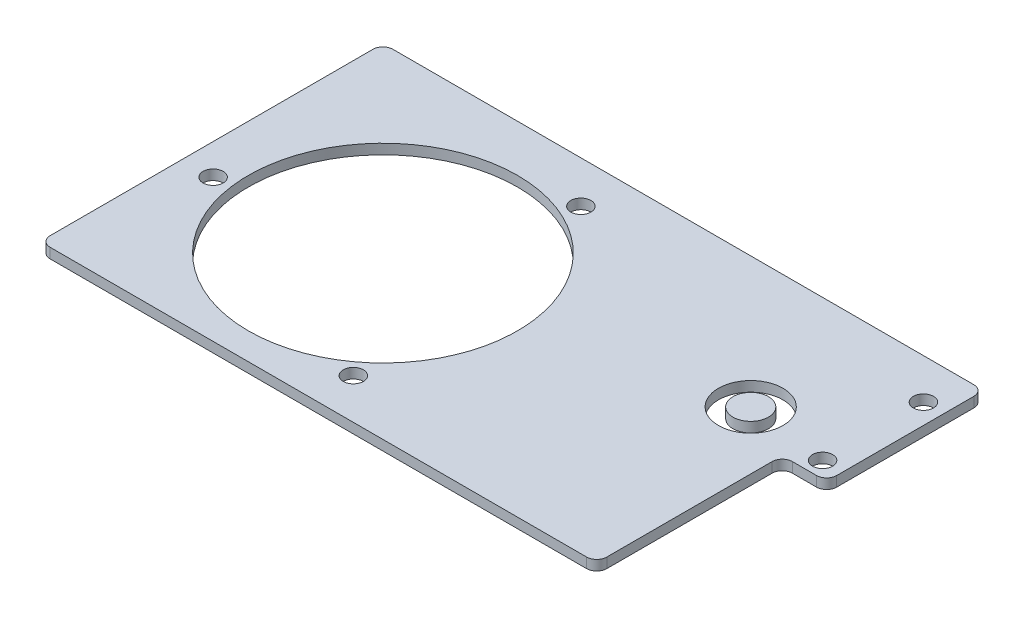
ISO-10303-21;
HEADER;
FILE_DESCRIPTION(('STEP AP214'),'2;1');
FILE_NAME('part.step','',(''),(''),'','','');
FILE_SCHEMA(('AUTOMOTIVE_DESIGN { 1 0 10303 214 1 1 1 1 }'));
ENDSEC;
DATA;
#1=APPLICATION_CONTEXT('core data for automotive mechanical design processes');
#2=APPLICATION_PROTOCOL_DEFINITION('international standard','automotive_design',2000,#1);
#3=PRODUCT_CONTEXT('',#1,'mechanical');
#4=PRODUCT('Part','Part','',(#3));
#5=PRODUCT_RELATED_PRODUCT_CATEGORY('part','',(#4));
#6=PRODUCT_DEFINITION_FORMATION('','',#4);
#7=PRODUCT_DEFINITION_CONTEXT('part definition',#1,'design');
#8=PRODUCT_DEFINITION('design','',#6,#7);
#9=PRODUCT_DEFINITION_SHAPE('','',#8);
#10=(LENGTH_UNIT() NAMED_UNIT(*) SI_UNIT(.MILLI.,.METRE.));
#11=(NAMED_UNIT(*) PLANE_ANGLE_UNIT() SI_UNIT($,.RADIAN.));
#12=(NAMED_UNIT(*) SI_UNIT($,.STERADIAN.) SOLID_ANGLE_UNIT());
#13=UNCERTAINTY_MEASURE_WITH_UNIT(LENGTH_MEASURE(1.E-05),#10,'distance_accuracy_value','');
#14=(GEOMETRIC_REPRESENTATION_CONTEXT(3) GLOBAL_UNCERTAINTY_ASSIGNED_CONTEXT((#13)) GLOBAL_UNIT_ASSIGNED_CONTEXT((#10,
#11,#12)) REPRESENTATION_CONTEXT('',''));
#15=CARTESIAN_POINT('',(0.,0.,0.));
#16=DIRECTION('',(0.,0.,1.));
#17=DIRECTION('',(1.,0.,0.));
#18=AXIS2_PLACEMENT_3D('',#15,#16,#17);
#19=CARTESIAN_POINT('',(242.57,6.35,-8.89000000000004));
#20=DIRECTION('',(0.,-1.,0.));
#21=DIRECTION('',(0.,0.,-1.));
#22=AXIS2_PLACEMENT_3D('',#19,#20,#21);
#23=PLANE('',#22);
#24=CARTESIAN_POINT('',(199.663269188543,6.35,-31.9495832888388));
#25=DIRECTION('',(0.,1.,0.));
#26=DIRECTION('',(0.,0.,1.));
#27=AXIS2_PLACEMENT_3D('',#24,#25,#26);
#28=CIRCLE('',#27,20.32);
#29=CARTESIAN_POINT('',(199.663269188543,6.35,-11.6295832888388));
#30=VERTEX_POINT('',#29);
#31=EDGE_CURVE('E12',#30,#30,#28,.T.);
#32=ORIENTED_EDGE('',*,*,#31,.F.);
#33=EDGE_LOOP('',(#32));
#34=FACE_BOUND('',#33,.T.);
#35=CARTESIAN_POINT('',(242.57,6.35,-8.89000000000004));
#36=DIRECTION('',(0.,-1.,0.));
#37=DIRECTION('',(0.,0.,-1.));
#38=AXIS2_PLACEMENT_3D('',#35,#36,#37);
#39=CIRCLE('',#38,6.35);
#40=CARTESIAN_POINT('',(236.22,6.35,-8.89000000000004));
#41=VERTEX_POINT('',#40);
#42=CARTESIAN_POINT('',(242.57,6.35,-15.24));
#43=VERTEX_POINT('',#42);
#44=EDGE_CURVE('E135',#41,#43,#39,.T.);
#45=ORIENTED_EDGE('',*,*,#44,.T.);
#46=DIRECTION('',(1.,0.,0.));
#47=VECTOR('',#46,1.);
#48=CARTESIAN_POINT('',(242.57,6.35,-15.24));
#49=LINE('',#48,#47);
#50=CARTESIAN_POINT('',(257.81,6.35,-15.2400000000001));
#51=VERTEX_POINT('',#50);
#52=EDGE_CURVE('E128',#43,#51,#49,.T.);
#53=ORIENTED_EDGE('',*,*,#52,.T.);
#54=CARTESIAN_POINT('',(257.81,6.35,-21.59));
#55=DIRECTION('',(0.,1.,0.));
#56=DIRECTION('',(0.,0.,1.));
#57=AXIS2_PLACEMENT_3D('',#54,#55,#56);
#58=CIRCLE('',#57,6.34999999999995);
#59=CARTESIAN_POINT('',(264.16,6.35,-21.59));
#60=VERTEX_POINT('',#59);
#61=EDGE_CURVE('E132',#51,#60,#58,.T.);
#62=ORIENTED_EDGE('',*,*,#61,.T.);
#63=DIRECTION('',(0.,0.,-1.));
#64=VECTOR('',#63,1.);
#65=CARTESIAN_POINT('',(264.16,6.35,-107.95));
#66=LINE('',#65,#64);
#67=CARTESIAN_POINT('',(264.16,6.35,-107.95));
#68=VERTEX_POINT('',#67);
#69=EDGE_CURVE('E153',#60,#68,#66,.T.);
#70=ORIENTED_EDGE('',*,*,#69,.T.);
#71=CARTESIAN_POINT('',(257.81,6.35,-107.95));
#72=DIRECTION('',(0.,1.,0.));
#73=DIRECTION('',(0.,0.,-1.));
#74=AXIS2_PLACEMENT_3D('',#71,#72,#73);
#75=CIRCLE('',#74,6.35000000000002);
#76=CARTESIAN_POINT('',(257.81,6.35,-114.3));
#77=VERTEX_POINT('',#76);
#78=EDGE_CURVE('E155',#68,#77,#75,.T.);
#79=ORIENTED_EDGE('',*,*,#78,.T.);
#80=DIRECTION('',(-1.,0.,0.));
#81=VECTOR('',#80,1.);
#82=CARTESIAN_POINT('',(257.81,6.35,-114.3));
#83=LINE('',#82,#81);
#84=CARTESIAN_POINT('',(-107.95,6.35,-114.3));
#85=VERTEX_POINT('',#84);
#86=EDGE_CURVE('E262',#77,#85,#83,.T.);
#87=ORIENTED_EDGE('',*,*,#86,.T.);
#88=CARTESIAN_POINT('',(-107.95,6.35,-107.95));
#89=DIRECTION('',(0.,1.,0.));
#90=DIRECTION('',(0.,0.,1.));
#91=AXIS2_PLACEMENT_3D('',#88,#89,#90);
#92=CIRCLE('',#91,6.34999999999995);
#93=CARTESIAN_POINT('',(-114.3,6.35,-107.95));
#94=VERTEX_POINT('',#93);
#95=EDGE_CURVE('E260',#85,#94,#92,.T.);
#96=ORIENTED_EDGE('',*,*,#95,.T.);
#97=DIRECTION('',(0.,0.,1.));
#98=VECTOR('',#97,1.);
#99=CARTESIAN_POINT('',(-114.3,6.35,-107.95));
#100=LINE('',#99,#98);
#101=CARTESIAN_POINT('',(-114.3,6.35,95.2500000000002));
#102=VERTEX_POINT('',#101);
#103=EDGE_CURVE('E258',#94,#102,#100,.T.);
#104=ORIENTED_EDGE('',*,*,#103,.T.);
#105=CARTESIAN_POINT('',(-107.95,6.35,95.2500000000002));
#106=DIRECTION('',(0.,1.,0.));
#107=DIRECTION('',(0.,0.,-1.));
#108=AXIS2_PLACEMENT_3D('',#105,#106,#107);
#109=CIRCLE('',#108,6.34999999999996);
#110=CARTESIAN_POINT('',(-107.95,6.35,101.6));
#111=VERTEX_POINT('',#110);
#112=EDGE_CURVE('E256',#102,#111,#109,.T.);
#113=ORIENTED_EDGE('',*,*,#112,.T.);
#114=DIRECTION('',(1.,0.,0.));
#115=VECTOR('',#114,1.);
#116=CARTESIAN_POINT('',(229.87,6.35,101.6));
#117=LINE('',#116,#115);
#118=CARTESIAN_POINT('',(229.87,6.35,101.6));
#119=VERTEX_POINT('',#118);
#120=EDGE_CURVE('E254',#111,#119,#117,.T.);
#121=ORIENTED_EDGE('',*,*,#120,.T.);
#122=CARTESIAN_POINT('',(229.87,6.35,95.25));
#123=DIRECTION('',(0.,1.,0.));
#124=DIRECTION('',(0.,0.,1.));
#125=AXIS2_PLACEMENT_3D('',#122,#123,#124);
#126=CIRCLE('',#125,6.34999999999999);
#127=CARTESIAN_POINT('',(236.22,6.35,95.25));
#128=VERTEX_POINT('',#127);
#129=EDGE_CURVE('E252',#119,#128,#126,.T.);
#130=ORIENTED_EDGE('',*,*,#129,.T.);
#131=DIRECTION('',(0.,0.,-1.));
#132=VECTOR('',#131,1.);
#133=CARTESIAN_POINT('',(236.22,6.35,95.25));
#134=LINE('',#133,#132);
#135=EDGE_CURVE('E190',#128,#41,#134,.T.);
#136=ORIENTED_EDGE('',*,*,#135,.T.);
#137=EDGE_LOOP('',(#45,#53,#62,#70,#79,#87,#96,#104,#113,#121,#130,#136));
#138=FACE_BOUND('',#137,.T.);
#139=CARTESIAN_POINT('',(0.,6.35,0.));
#140=DIRECTION('',(0.,1.,0.));
#141=DIRECTION('',(0.,0.,1.));
#142=AXIS2_PLACEMENT_3D('',#139,#140,#141);
#143=CIRCLE('',#142,84.7725);
#144=CARTESIAN_POINT('',(0.,6.35,84.7725));
#145=VERTEX_POINT('',#144);
#146=EDGE_CURVE('E165',#145,#145,#143,.T.);
#147=ORIENTED_EDGE('',*,*,#146,.F.);
#148=EDGE_LOOP('',(#147));
#149=FACE_BOUND('',#148,.T.);
#150=CARTESIAN_POINT('',(-94.8681670919897,6.35,12.0662470579357));
#151=DIRECTION('',(0.,1.,0.));
#152=DIRECTION('',(0.,0.,1.));
#153=AXIS2_PLACEMENT_3D('',#150,#151,#152);
#154=CIRCLE('',#153,6.35);
#155=CARTESIAN_POINT('',(-94.8681670919897,6.35,18.4162470579357));
#156=VERTEX_POINT('',#155);
#157=EDGE_CURVE('E168',#156,#156,#154,.T.);
#158=ORIENTED_EDGE('',*,*,#157,.F.);
#159=EDGE_LOOP('',(#158));
#160=FACE_BOUND('',#159,.T.);
#161=CARTESIAN_POINT('',(251.46,6.35,-88.9000000000001));
#162=DIRECTION('',(0.,1.,0.));
#163=DIRECTION('',(0.,0.,1.));
#164=AXIS2_PLACEMENT_3D('',#161,#162,#163);
#165=CIRCLE('',#164,6.35);
#166=CARTESIAN_POINT('',(251.46,6.35,-82.5500000000001));
#167=VERTEX_POINT('',#166);
#168=EDGE_CURVE('E175',#167,#167,#165,.T.);
#169=ORIENTED_EDGE('',*,*,#168,.F.);
#170=EDGE_LOOP('',(#169));
#171=FACE_BOUND('',#170,.T.);
#172=CARTESIAN_POINT('',(251.46,6.35,-25.4000000000001));
#173=DIRECTION('',(0.,1.,0.));
#174=DIRECTION('',(0.,0.,1.));
#175=AXIS2_PLACEMENT_3D('',#172,#173,#174);
#176=CIRCLE('',#175,6.35);
#177=CARTESIAN_POINT('',(251.46,6.35,-19.0500000000001));
#178=VERTEX_POINT('',#177);
#179=EDGE_CURVE('E181',#178,#178,#176,.T.);
#180=ORIENTED_EDGE('',*,*,#179,.F.);
#181=EDGE_LOOP('',(#180));
#182=FACE_BOUND('',#181,.T.);
#183=CARTESIAN_POINT('',(36.7916406639406,6.35,-87.8574850383021));
#184=DIRECTION('',(0.,1.,0.));
#185=DIRECTION('',(0.,0.,1.));
#186=AXIS2_PLACEMENT_3D('',#183,#184,#185);
#187=CIRCLE('',#186,6.34999999999998);
#188=CARTESIAN_POINT('',(36.7916406639406,6.35,-81.5074850383022));
#189=VERTEX_POINT('',#188);
#190=EDGE_CURVE('E187',#189,#189,#187,.T.);
#191=ORIENTED_EDGE('',*,*,#190,.F.);
#192=EDGE_LOOP('',(#191));
#193=FACE_BOUND('',#192,.T.);
#194=CARTESIAN_POINT('',(57.4982272222679,6.35,76.1251191838279));
#195=DIRECTION('',(0.,1.,0.));
#196=DIRECTION('',(0.,0.,1.));
#197=AXIS2_PLACEMENT_3D('',#194,#195,#196);
#198=CIRCLE('',#197,6.34999999999999);
#199=CARTESIAN_POINT('',(57.4982272222679,6.35,82.4751191838279));
#200=VERTEX_POINT('',#199);
#201=EDGE_CURVE('E193',#200,#200,#198,.T.);
#202=ORIENTED_EDGE('',*,*,#201,.F.);
#203=EDGE_LOOP('',(#202));
#204=FACE_BOUND('',#203,.T.);
#205=ADVANCED_FACE('F43',(#34,#138,#149,#160,#171,#182,#193,#204),#23,.F.);
#206=CARTESIAN_POINT('',(242.57,0.,-8.89000000000004));
#207=DIRECTION('',(0.,-1.,0.));
#208=DIRECTION('',(0.,0.,-1.));
#209=AXIS2_PLACEMENT_3D('',#206,#207,#208);
#210=PLANE('',#209);
#211=CARTESIAN_POINT('',(199.663269188543,0.,-31.9495832888388));
#212=DIRECTION('',(0.,-1.,0.));
#213=DIRECTION('',(0.,0.,-1.));
#214=AXIS2_PLACEMENT_3D('',#211,#212,#213);
#215=CIRCLE('',#214,20.32);
#216=CARTESIAN_POINT('',(199.663269188543,0.,-52.2695832888388));
#217=VERTEX_POINT('',#216);
#218=EDGE_CURVE('E51',#217,#217,#215,.T.);
#219=ORIENTED_EDGE('',*,*,#218,.F.);
#220=EDGE_LOOP('',(#219));
#221=FACE_BOUND('',#220,.T.);
#222=CARTESIAN_POINT('',(36.7916406639406,0.,-87.8574850383021));
#223=DIRECTION('',(0.,1.,0.));
#224=DIRECTION('',(0.,0.,1.));
#225=AXIS2_PLACEMENT_3D('',#222,#223,#224);
#226=CIRCLE('',#225,6.34999999999998);
#227=CARTESIAN_POINT('',(36.7916406639406,0.,-81.5074850383022));
#228=VERTEX_POINT('',#227);
#229=EDGE_CURVE('E178',#228,#228,#226,.T.);
#230=ORIENTED_EDGE('',*,*,#229,.T.);
#231=EDGE_LOOP('',(#230));
#232=FACE_BOUND('',#231,.T.);
#233=CARTESIAN_POINT('',(251.46,0.,-88.9000000000001));
#234=DIRECTION('',(0.,1.,0.));
#235=DIRECTION('',(0.,0.,1.));
#236=AXIS2_PLACEMENT_3D('',#233,#234,#235);
#237=CIRCLE('',#236,6.35);
#238=CARTESIAN_POINT('',(251.46,0.,-82.5500000000001));
#239=VERTEX_POINT('',#238);
#240=EDGE_CURVE('E164',#239,#239,#237,.T.);
#241=ORIENTED_EDGE('',*,*,#240,.T.);
#242=EDGE_LOOP('',(#241));
#243=FACE_BOUND('',#242,.T.);
#244=CARTESIAN_POINT('',(0.,0.,0.));
#245=DIRECTION('',(0.,1.,0.));
#246=DIRECTION('',(0.,0.,1.));
#247=AXIS2_PLACEMENT_3D('',#244,#245,#246);
#248=CIRCLE('',#247,84.7725);
#249=CARTESIAN_POINT('',(0.,0.,84.7725));
#250=VERTEX_POINT('',#249);
#251=EDGE_CURVE('E160',#250,#250,#248,.T.);
#252=ORIENTED_EDGE('',*,*,#251,.T.);
#253=EDGE_LOOP('',(#252));
#254=FACE_BOUND('',#253,.T.);
#255=CARTESIAN_POINT('',(242.57,0.,-8.89000000000004));
#256=DIRECTION('',(0.,-1.,0.));
#257=DIRECTION('',(0.,0.,-1.));
#258=AXIS2_PLACEMENT_3D('',#255,#256,#257);
#259=CIRCLE('',#258,6.35);
#260=CARTESIAN_POINT('',(236.22,0.,-8.89000000000004));
#261=VERTEX_POINT('',#260);
#262=CARTESIAN_POINT('',(242.57,0.,-15.24));
#263=VERTEX_POINT('',#262);
#264=EDGE_CURVE('E195',#261,#263,#259,.T.);
#265=ORIENTED_EDGE('',*,*,#264,.F.);
#266=DIRECTION('',(0.,0.,-1.));
#267=VECTOR('',#266,1.);
#268=CARTESIAN_POINT('',(236.22,0.,95.25));
#269=LINE('',#268,#267);
#270=CARTESIAN_POINT('',(236.22,0.,95.25));
#271=VERTEX_POINT('',#270);
#272=EDGE_CURVE('E59',#271,#261,#269,.T.);
#273=ORIENTED_EDGE('',*,*,#272,.F.);
#274=CARTESIAN_POINT('',(229.87,0.,95.25));
#275=DIRECTION('',(0.,1.,0.));
#276=DIRECTION('',(0.,0.,1.));
#277=AXIS2_PLACEMENT_3D('',#274,#275,#276);
#278=CIRCLE('',#277,6.34999999999999);
#279=CARTESIAN_POINT('',(229.87,0.,101.6));
#280=VERTEX_POINT('',#279);
#281=EDGE_CURVE('E231',#280,#271,#278,.T.);
#282=ORIENTED_EDGE('',*,*,#281,.F.);
#283=DIRECTION('',(1.,0.,0.));
#284=VECTOR('',#283,1.);
#285=CARTESIAN_POINT('',(229.87,0.,101.6));
#286=LINE('',#285,#284);
#287=CARTESIAN_POINT('',(-107.95,0.,101.6));
#288=VERTEX_POINT('',#287);
#289=EDGE_CURVE('E227',#288,#280,#286,.T.);
#290=ORIENTED_EDGE('',*,*,#289,.F.);
#291=CARTESIAN_POINT('',(-107.95,0.,95.2500000000002));
#292=DIRECTION('',(0.,1.,0.));
#293=DIRECTION('',(0.,0.,-1.));
#294=AXIS2_PLACEMENT_3D('',#291,#292,#293);
#295=CIRCLE('',#294,6.34999999999996);
#296=CARTESIAN_POINT('',(-114.3,0.,95.2500000000002));
#297=VERTEX_POINT('',#296);
#298=EDGE_CURVE('E223',#297,#288,#295,.T.);
#299=ORIENTED_EDGE('',*,*,#298,.F.);
#300=DIRECTION('',(0.,0.,1.));
#301=VECTOR('',#300,1.);
#302=CARTESIAN_POINT('',(-114.3,0.,-107.95));
#303=LINE('',#302,#301);
#304=CARTESIAN_POINT('',(-114.3,0.,-107.95));
#305=VERTEX_POINT('',#304);
#306=EDGE_CURVE('E219',#305,#297,#303,.T.);
#307=ORIENTED_EDGE('',*,*,#306,.F.);
#308=CARTESIAN_POINT('',(-107.95,0.,-107.95));
#309=DIRECTION('',(0.,1.,0.));
#310=DIRECTION('',(0.,0.,1.));
#311=AXIS2_PLACEMENT_3D('',#308,#309,#310);
#312=CIRCLE('',#311,6.34999999999995);
#313=CARTESIAN_POINT('',(-107.95,0.,-114.3));
#314=VERTEX_POINT('',#313);
#315=EDGE_CURVE('E215',#314,#305,#312,.T.);
#316=ORIENTED_EDGE('',*,*,#315,.F.);
#317=DIRECTION('',(-1.,0.,0.));
#318=VECTOR('',#317,1.);
#319=CARTESIAN_POINT('',(257.81,0.,-114.3));
#320=LINE('',#319,#318);
#321=CARTESIAN_POINT('',(257.81,0.,-114.3));
#322=VERTEX_POINT('',#321);
#323=EDGE_CURVE('E211',#322,#314,#320,.T.);
#324=ORIENTED_EDGE('',*,*,#323,.F.);
#325=CARTESIAN_POINT('',(257.81,0.,-107.95));
#326=DIRECTION('',(0.,1.,0.));
#327=DIRECTION('',(0.,0.,-1.));
#328=AXIS2_PLACEMENT_3D('',#325,#326,#327);
#329=CIRCLE('',#328,6.35000000000002);
#330=CARTESIAN_POINT('',(264.16,0.,-107.95));
#331=VERTEX_POINT('',#330);
#332=EDGE_CURVE('E207',#331,#322,#329,.T.);
#333=ORIENTED_EDGE('',*,*,#332,.F.);
#334=DIRECTION('',(0.,0.,-1.));
#335=VECTOR('',#334,1.);
#336=CARTESIAN_POINT('',(264.16,0.,-107.95));
#337=LINE('',#336,#335);
#338=CARTESIAN_POINT('',(264.16,0.,-21.59));
#339=VERTEX_POINT('',#338);
#340=EDGE_CURVE('E146',#339,#331,#337,.T.);
#341=ORIENTED_EDGE('',*,*,#340,.F.);
#342=CARTESIAN_POINT('',(257.81,0.,-21.59));
#343=DIRECTION('',(0.,1.,0.));
#344=DIRECTION('',(0.,0.,1.));
#345=AXIS2_PLACEMENT_3D('',#342,#343,#344);
#346=CIRCLE('',#345,6.34999999999995);
#347=CARTESIAN_POINT('',(257.81,0.,-15.2400000000001));
#348=VERTEX_POINT('',#347);
#349=EDGE_CURVE('E147',#348,#339,#346,.T.);
#350=ORIENTED_EDGE('',*,*,#349,.F.);
#351=DIRECTION('',(1.,0.,0.));
#352=VECTOR('',#351,1.);
#353=CARTESIAN_POINT('',(242.57,0.,-15.24));
#354=LINE('',#353,#352);
#355=EDGE_CURVE('E143',#263,#348,#354,.T.);
#356=ORIENTED_EDGE('',*,*,#355,.F.);
#357=EDGE_LOOP('',(#265,#273,#282,#290,#299,#307,#316,#324,#333,#341,#350,#356));
#358=FACE_BOUND('',#357,.T.);
#359=CARTESIAN_POINT('',(-94.8681670919897,0.,12.0662470579357));
#360=DIRECTION('',(0.,1.,0.));
#361=DIRECTION('',(0.,0.,1.));
#362=AXIS2_PLACEMENT_3D('',#359,#360,#361);
#363=CIRCLE('',#362,6.35);
#364=CARTESIAN_POINT('',(-94.8681670919897,0.,18.4162470579357));
#365=VERTEX_POINT('',#364);
#366=EDGE_CURVE('E163',#365,#365,#363,.T.);
#367=ORIENTED_EDGE('',*,*,#366,.T.);
#368=EDGE_LOOP('',(#367));
#369=FACE_BOUND('',#368,.T.);
#370=CARTESIAN_POINT('',(251.46,0.,-25.4000000000001));
#371=DIRECTION('',(0.,1.,0.));
#372=DIRECTION('',(0.,0.,1.));
#373=AXIS2_PLACEMENT_3D('',#370,#371,#372);
#374=CIRCLE('',#373,6.35);
#375=CARTESIAN_POINT('',(251.46,0.,-19.0500000000001));
#376=VERTEX_POINT('',#375);
#377=EDGE_CURVE('E172',#376,#376,#374,.T.);
#378=ORIENTED_EDGE('',*,*,#377,.T.);
#379=EDGE_LOOP('',(#378));
#380=FACE_BOUND('',#379,.T.);
#381=CARTESIAN_POINT('',(57.4982272222679,0.,76.1251191838279));
#382=DIRECTION('',(0.,1.,0.));
#383=DIRECTION('',(0.,0.,1.));
#384=AXIS2_PLACEMENT_3D('',#381,#382,#383);
#385=CIRCLE('',#384,6.34999999999999);
#386=CARTESIAN_POINT('',(57.4982272222679,0.,82.4751191838279));
#387=VERTEX_POINT('',#386);
#388=EDGE_CURVE('E184',#387,#387,#385,.T.);
#389=ORIENTED_EDGE('',*,*,#388,.T.);
#390=EDGE_LOOP('',(#389));
#391=FACE_BOUND('',#390,.T.);
#392=ADVANCED_FACE('F305',(#221,#232,#243,#254,#358,#369,#380,#391),#210,.T.);
#393=CARTESIAN_POINT('',(242.57,6.35,-8.89000000000004));
#394=DIRECTION('',(0.,-1.,0.));
#395=DIRECTION('',(0.,0.,-1.));
#396=AXIS2_PLACEMENT_3D('',#393,#394,#395);
#397=CYLINDRICAL_SURFACE('',#396,6.35);
#398=ORIENTED_EDGE('',*,*,#264,.T.);
#399=DIRECTION('',(0.,-1.,0.));
#400=VECTOR('',#399,1.);
#401=CARTESIAN_POINT('',(242.57,6.35,-15.24));
#402=LINE('',#401,#400);
#403=EDGE_CURVE('E204',#43,#263,#402,.T.);
#404=ORIENTED_EDGE('',*,*,#403,.F.);
#405=ORIENTED_EDGE('',*,*,#44,.F.);
#406=DIRECTION('',(0.,-1.,0.));
#407=VECTOR('',#406,1.);
#408=CARTESIAN_POINT('',(236.22,6.35,-8.89000000000004));
#409=LINE('',#408,#407);
#410=EDGE_CURVE('E236',#41,#261,#409,.T.);
#411=ORIENTED_EDGE('',*,*,#410,.T.);
#412=EDGE_LOOP('',(#398,#404,#405,#411));
#413=FACE_BOUND('',#412,.T.);
#414=ADVANCED_FACE('F303',(#413),#397,.F.);
#415=CARTESIAN_POINT('',(242.57,6.35,-15.24));
#416=DIRECTION('',(0.,0.,-1.));
#417=DIRECTION('',(-1.,0.,0.));
#418=AXIS2_PLACEMENT_3D('',#415,#416,#417);
#419=PLANE('',#418);
#420=ORIENTED_EDGE('',*,*,#355,.T.);
#421=DIRECTION('',(0.,-1.,0.));
#422=VECTOR('',#421,1.);
#423=CARTESIAN_POINT('',(257.81,6.35,-15.2400000000001));
#424=LINE('',#423,#422);
#425=EDGE_CURVE('E141',#51,#348,#424,.T.);
#426=ORIENTED_EDGE('',*,*,#425,.F.);
#427=ORIENTED_EDGE('',*,*,#52,.F.);
#428=ORIENTED_EDGE('',*,*,#403,.T.);
#429=EDGE_LOOP('',(#420,#426,#427,#428));
#430=FACE_BOUND('',#429,.T.);
#431=ADVANCED_FACE('F142',(#430),#419,.F.);
#432=CARTESIAN_POINT('',(257.81,6.35,-21.59));
#433=DIRECTION('',(0.,-1.,0.));
#434=DIRECTION('',(0.,0.,-1.));
#435=AXIS2_PLACEMENT_3D('',#432,#433,#434);
#436=CYLINDRICAL_SURFACE('',#435,6.34999999999995);
#437=ORIENTED_EDGE('',*,*,#349,.T.);
#438=DIRECTION('',(0.,-1.,0.));
#439=VECTOR('',#438,1.);
#440=CARTESIAN_POINT('',(264.16,6.35,-21.59));
#441=LINE('',#440,#439);
#442=EDGE_CURVE('E151',#60,#339,#441,.T.);
#443=ORIENTED_EDGE('',*,*,#442,.F.);
#444=ORIENTED_EDGE('',*,*,#61,.F.);
#445=ORIENTED_EDGE('',*,*,#425,.T.);
#446=EDGE_LOOP('',(#437,#443,#444,#445));
#447=FACE_BOUND('',#446,.T.);
#448=ADVANCED_FACE('F149',(#447),#436,.T.);
#449=CARTESIAN_POINT('',(264.16,6.35,-107.95));
#450=DIRECTION('',(-1.,0.,0.));
#451=DIRECTION('',(0.,0.,1.));
#452=AXIS2_PLACEMENT_3D('',#449,#450,#451);
#453=PLANE('',#452);
#454=ORIENTED_EDGE('',*,*,#340,.T.);
#455=DIRECTION('',(0.,-1.,0.));
#456=VECTOR('',#455,1.);
#457=CARTESIAN_POINT('',(264.16,6.35,-107.95));
#458=LINE('',#457,#456);
#459=EDGE_CURVE('E208',#68,#331,#458,.T.);
#460=ORIENTED_EDGE('',*,*,#459,.F.);
#461=ORIENTED_EDGE('',*,*,#69,.F.);
#462=ORIENTED_EDGE('',*,*,#442,.T.);
#463=EDGE_LOOP('',(#454,#460,#461,#462));
#464=FACE_BOUND('',#463,.T.);
#465=ADVANCED_FACE('F309',(#464),#453,.F.);
#466=CARTESIAN_POINT('',(257.81,6.35,-107.95));
#467=DIRECTION('',(0.,-1.,0.));
#468=DIRECTION('',(0.,0.,-1.));
#469=AXIS2_PLACEMENT_3D('',#466,#467,#468);
#470=CYLINDRICAL_SURFACE('',#469,6.35000000000002);
#471=ORIENTED_EDGE('',*,*,#332,.T.);
#472=DIRECTION('',(0.,-1.,0.));
#473=VECTOR('',#472,1.);
#474=CARTESIAN_POINT('',(257.81,6.35,-114.3));
#475=LINE('',#474,#473);
#476=EDGE_CURVE('E212',#77,#322,#475,.T.);
#477=ORIENTED_EDGE('',*,*,#476,.F.);
#478=ORIENTED_EDGE('',*,*,#78,.F.);
#479=ORIENTED_EDGE('',*,*,#459,.T.);
#480=EDGE_LOOP('',(#471,#477,#478,#479));
#481=FACE_BOUND('',#480,.T.);
#482=ADVANCED_FACE('F269',(#481),#470,.T.);
#483=CARTESIAN_POINT('',(257.81,6.35,-114.3));
#484=DIRECTION('',(0.,0.,1.));
#485=DIRECTION('',(1.,0.,0.));
#486=AXIS2_PLACEMENT_3D('',#483,#484,#485);
#487=PLANE('',#486);
#488=ORIENTED_EDGE('',*,*,#323,.T.);
#489=DIRECTION('',(0.,-1.,0.));
#490=VECTOR('',#489,1.);
#491=CARTESIAN_POINT('',(-107.95,6.35,-114.3));
#492=LINE('',#491,#490);
#493=EDGE_CURVE('E216',#85,#314,#492,.T.);
#494=ORIENTED_EDGE('',*,*,#493,.F.);
#495=ORIENTED_EDGE('',*,*,#86,.F.);
#496=ORIENTED_EDGE('',*,*,#476,.T.);
#497=EDGE_LOOP('',(#488,#494,#495,#496));
#498=FACE_BOUND('',#497,.T.);
#499=ADVANCED_FACE('F273',(#498),#487,.F.);
#500=CARTESIAN_POINT('',(-107.95,6.35,-107.95));
#501=DIRECTION('',(0.,-1.,0.));
#502=DIRECTION('',(0.,0.,-1.));
#503=AXIS2_PLACEMENT_3D('',#500,#501,#502);
#504=CYLINDRICAL_SURFACE('',#503,6.34999999999995);
#505=ORIENTED_EDGE('',*,*,#315,.T.);
#506=DIRECTION('',(0.,-1.,0.));
#507=VECTOR('',#506,1.);
#508=CARTESIAN_POINT('',(-114.3,6.35,-107.95));
#509=LINE('',#508,#507);
#510=EDGE_CURVE('E220',#94,#305,#509,.T.);
#511=ORIENTED_EDGE('',*,*,#510,.F.);
#512=ORIENTED_EDGE('',*,*,#95,.F.);
#513=ORIENTED_EDGE('',*,*,#493,.T.);
#514=EDGE_LOOP('',(#505,#511,#512,#513));
#515=FACE_BOUND('',#514,.T.);
#516=ADVANCED_FACE('F278',(#515),#504,.T.);
#517=CARTESIAN_POINT('',(-114.3,6.35,-107.95));
#518=DIRECTION('',(1.,0.,0.));
#519=DIRECTION('',(0.,0.,-1.));
#520=AXIS2_PLACEMENT_3D('',#517,#518,#519);
#521=PLANE('',#520);
#522=ORIENTED_EDGE('',*,*,#306,.T.);
#523=DIRECTION('',(0.,-1.,0.));
#524=VECTOR('',#523,1.);
#525=CARTESIAN_POINT('',(-114.3,6.35,95.2500000000002));
#526=LINE('',#525,#524);
#527=EDGE_CURVE('E224',#102,#297,#526,.T.);
#528=ORIENTED_EDGE('',*,*,#527,.F.);
#529=ORIENTED_EDGE('',*,*,#103,.F.);
#530=ORIENTED_EDGE('',*,*,#510,.T.);
#531=EDGE_LOOP('',(#522,#528,#529,#530));
#532=FACE_BOUND('',#531,.T.);
#533=ADVANCED_FACE('F284',(#532),#521,.F.);
#534=CARTESIAN_POINT('',(-107.95,6.35,95.2500000000002));
#535=DIRECTION('',(0.,-1.,0.));
#536=DIRECTION('',(0.,0.,-1.));
#537=AXIS2_PLACEMENT_3D('',#534,#535,#536);
#538=CYLINDRICAL_SURFACE('',#537,6.34999999999996);
#539=ORIENTED_EDGE('',*,*,#298,.T.);
#540=DIRECTION('',(0.,-1.,0.));
#541=VECTOR('',#540,1.);
#542=CARTESIAN_POINT('',(-107.95,6.35,101.6));
#543=LINE('',#542,#541);
#544=EDGE_CURVE('E228',#111,#288,#543,.T.);
#545=ORIENTED_EDGE('',*,*,#544,.F.);
#546=ORIENTED_EDGE('',*,*,#112,.F.);
#547=ORIENTED_EDGE('',*,*,#527,.T.);
#548=EDGE_LOOP('',(#539,#545,#546,#547));
#549=FACE_BOUND('',#548,.T.);
#550=ADVANCED_FACE('F288',(#549),#538,.T.);
#551=CARTESIAN_POINT('',(229.87,6.35,101.6));
#552=DIRECTION('',(0.,0.,-1.));
#553=DIRECTION('',(-1.,0.,0.));
#554=AXIS2_PLACEMENT_3D('',#551,#552,#553);
#555=PLANE('',#554);
#556=ORIENTED_EDGE('',*,*,#289,.T.);
#557=DIRECTION('',(0.,-1.,0.));
#558=VECTOR('',#557,1.);
#559=CARTESIAN_POINT('',(229.87,6.35,101.6));
#560=LINE('',#559,#558);
#561=EDGE_CURVE('E232',#119,#280,#560,.T.);
#562=ORIENTED_EDGE('',*,*,#561,.F.);
#563=ORIENTED_EDGE('',*,*,#120,.F.);
#564=ORIENTED_EDGE('',*,*,#544,.T.);
#565=EDGE_LOOP('',(#556,#562,#563,#564));
#566=FACE_BOUND('',#565,.T.);
#567=ADVANCED_FACE('F293',(#566),#555,.F.);
#568=CARTESIAN_POINT('',(229.87,6.35,95.25));
#569=DIRECTION('',(0.,-1.,0.));
#570=DIRECTION('',(0.,0.,-1.));
#571=AXIS2_PLACEMENT_3D('',#568,#569,#570);
#572=CYLINDRICAL_SURFACE('',#571,6.34999999999999);
#573=ORIENTED_EDGE('',*,*,#281,.T.);
#574=DIRECTION('',(0.,-1.,0.));
#575=VECTOR('',#574,1.);
#576=CARTESIAN_POINT('',(236.22,6.35,95.25));
#577=LINE('',#576,#575);
#578=EDGE_CURVE('E169',#128,#271,#577,.T.);
#579=ORIENTED_EDGE('',*,*,#578,.F.);
#580=ORIENTED_EDGE('',*,*,#129,.F.);
#581=ORIENTED_EDGE('',*,*,#561,.T.);
#582=EDGE_LOOP('',(#573,#579,#580,#581));
#583=FACE_BOUND('',#582,.T.);
#584=ADVANCED_FACE('F298',(#583),#572,.T.);
#585=CARTESIAN_POINT('',(236.22,6.35,95.25));
#586=DIRECTION('',(-1.,0.,0.));
#587=DIRECTION('',(0.,0.,1.));
#588=AXIS2_PLACEMENT_3D('',#585,#586,#587);
#589=PLANE('',#588);
#590=ORIENTED_EDGE('',*,*,#272,.T.);
#591=ORIENTED_EDGE('',*,*,#410,.F.);
#592=ORIENTED_EDGE('',*,*,#135,.F.);
#593=ORIENTED_EDGE('',*,*,#578,.T.);
#594=EDGE_LOOP('',(#590,#591,#592,#593));
#595=FACE_BOUND('',#594,.T.);
#596=ADVANCED_FACE('F300',(#595),#589,.F.);
#597=CARTESIAN_POINT('',(0.,6.35,0.));
#598=DIRECTION('',(0.,-1.,0.));
#599=DIRECTION('',(0.,0.,-1.));
#600=AXIS2_PLACEMENT_3D('',#597,#598,#599);
#601=CYLINDRICAL_SURFACE('',#600,84.7725);
#602=ORIENTED_EDGE('',*,*,#146,.T.);
#603=EDGE_LOOP('',(#602));
#604=FACE_BOUND('',#603,.T.);
#605=ORIENTED_EDGE('',*,*,#251,.F.);
#606=EDGE_LOOP('',(#605));
#607=FACE_BOUND('',#606,.T.);
#608=ADVANCED_FACE('F350',(#604,#607),#601,.F.);
#609=CARTESIAN_POINT('',(-94.8681670919897,6.35,12.0662470579357));
#610=DIRECTION('',(0.,-1.,0.));
#611=DIRECTION('',(0.,0.,-1.));
#612=AXIS2_PLACEMENT_3D('',#609,#610,#611);
#613=CYLINDRICAL_SURFACE('',#612,6.35);
#614=ORIENTED_EDGE('',*,*,#157,.T.);
#615=EDGE_LOOP('',(#614));
#616=FACE_BOUND('',#615,.T.);
#617=ORIENTED_EDGE('',*,*,#366,.F.);
#618=EDGE_LOOP('',(#617));
#619=FACE_BOUND('',#618,.T.);
#620=ADVANCED_FACE('F346',(#616,#619),#613,.F.);
#621=CARTESIAN_POINT('',(251.46,6.35,-88.9000000000001));
#622=DIRECTION('',(0.,-1.,0.));
#623=DIRECTION('',(0.,0.,-1.));
#624=AXIS2_PLACEMENT_3D('',#621,#622,#623);
#625=CYLINDRICAL_SURFACE('',#624,6.35);
#626=ORIENTED_EDGE('',*,*,#168,.T.);
#627=EDGE_LOOP('',(#626));
#628=FACE_BOUND('',#627,.T.);
#629=ORIENTED_EDGE('',*,*,#240,.F.);
#630=EDGE_LOOP('',(#629));
#631=FACE_BOUND('',#630,.T.);
#632=ADVANCED_FACE('F342',(#628,#631),#625,.F.);
#633=CARTESIAN_POINT('',(251.46,6.35,-25.4000000000001));
#634=DIRECTION('',(0.,-1.,0.));
#635=DIRECTION('',(0.,0.,-1.));
#636=AXIS2_PLACEMENT_3D('',#633,#634,#635);
#637=CYLINDRICAL_SURFACE('',#636,6.35);
#638=ORIENTED_EDGE('',*,*,#179,.T.);
#639=EDGE_LOOP('',(#638));
#640=FACE_BOUND('',#639,.T.);
#641=ORIENTED_EDGE('',*,*,#377,.F.);
#642=EDGE_LOOP('',(#641));
#643=FACE_BOUND('',#642,.T.);
#644=ADVANCED_FACE('F338',(#640,#643),#637,.F.);
#645=CARTESIAN_POINT('',(36.7916406639406,6.35,-87.8574850383021));
#646=DIRECTION('',(0.,-1.,0.));
#647=DIRECTION('',(0.,0.,-1.));
#648=AXIS2_PLACEMENT_3D('',#645,#646,#647);
#649=CYLINDRICAL_SURFACE('',#648,6.34999999999998);
#650=ORIENTED_EDGE('',*,*,#190,.T.);
#651=EDGE_LOOP('',(#650));
#652=FACE_BOUND('',#651,.T.);
#653=ORIENTED_EDGE('',*,*,#229,.F.);
#654=EDGE_LOOP('',(#653));
#655=FACE_BOUND('',#654,.T.);
#656=ADVANCED_FACE('F333',(#652,#655),#649,.F.);
#657=CARTESIAN_POINT('',(57.4982272222679,6.35,76.1251191838279));
#658=DIRECTION('',(0.,-1.,0.));
#659=DIRECTION('',(0.,0.,-1.));
#660=AXIS2_PLACEMENT_3D('',#657,#658,#659);
#661=CYLINDRICAL_SURFACE('',#660,6.34999999999999);
#662=ORIENTED_EDGE('',*,*,#201,.T.);
#663=EDGE_LOOP('',(#662));
#664=FACE_BOUND('',#663,.T.);
#665=ORIENTED_EDGE('',*,*,#388,.F.);
#666=EDGE_LOOP('',(#665));
#667=FACE_BOUND('',#666,.T.);
#668=ADVANCED_FACE('F328',(#664,#667),#661,.F.);
#669=CARTESIAN_POINT('',(199.663269188543,-3.302,-31.9495832888388));
#670=DIRECTION('',(0.,1.,0.));
#671=DIRECTION('',(0.,0.,1.));
#672=AXIS2_PLACEMENT_3D('',#669,#670,#671);
#673=CYLINDRICAL_SURFACE('',#672,20.32);
#674=ORIENTED_EDGE('',*,*,#218,.T.);
#675=EDGE_LOOP('',(#674));
#676=FACE_BOUND('',#675,.T.);
#677=ORIENTED_EDGE('',*,*,#31,.T.);
#678=EDGE_LOOP('',(#677));
#679=FACE_BOUND('',#678,.T.);
#680=ADVANCED_FACE('F326',(#676,#679),#673,.F.);
#681=CLOSED_SHELL('',(#205,#392,#414,#431,#448,#465,#482,#499,#516,#533,#550,#567,#584,#596,
#608,#620,#632,#644,#656,#668,#680));
#682=MANIFOLD_SOLID_BREP('B2',#681);
#683=CARTESIAN_POINT('',(242.57,0.,-8.89000000000004));
#684=DIRECTION('',(0.,-1.,0.));
#685=DIRECTION('',(0.,0.,-1.));
#686=AXIS2_PLACEMENT_3D('',#683,#684,#685);
#687=PLANE('',#686);
#688=CARTESIAN_POINT('',(199.663269188543,0.,-31.9495832888388));
#689=DIRECTION('',(0.,-1.,0.));
#690=DIRECTION('',(0.,0.,-1.));
#691=AXIS2_PLACEMENT_3D('',#688,#689,#690);
#692=CIRCLE('',#691,11.176);
#693=CARTESIAN_POINT('',(199.663269188543,0.,-43.1255832888388));
#694=VERTEX_POINT('',#693);
#695=EDGE_CURVE('E42',#694,#694,#692,.T.);
#696=ORIENTED_EDGE('',*,*,#695,.T.);
#697=EDGE_LOOP('',(#696));
#698=FACE_BOUND('',#697,.T.);
#699=ADVANCED_FACE('F534',(#698),#687,.T.);
#700=CARTESIAN_POINT('',(199.663269188543,-3.302,-31.9495832888388));
#701=DIRECTION('',(0.,1.,0.));
#702=DIRECTION('',(0.,0.,1.));
#703=AXIS2_PLACEMENT_3D('',#700,#701,#702);
#704=CYLINDRICAL_SURFACE('',#703,11.176);
#705=ORIENTED_EDGE('',*,*,#695,.F.);
#706=EDGE_LOOP('',(#705));
#707=FACE_BOUND('',#706,.T.);
#708=CARTESIAN_POINT('',(199.663269188543,6.35,-31.9495832888388));
#709=DIRECTION('',(0.,1.,0.));
#710=DIRECTION('',(0.,0.,1.));
#711=AXIS2_PLACEMENT_3D('',#708,#709,#710);
#712=CIRCLE('',#711,11.176);
#713=CARTESIAN_POINT('',(199.663269188543,6.35,-20.7735832888388));
#714=VERTEX_POINT('',#713);
#715=EDGE_CURVE('E540',#714,#714,#712,.T.);
#716=ORIENTED_EDGE('',*,*,#715,.F.);
#717=EDGE_LOOP('',(#716));
#718=FACE_BOUND('',#717,.T.);
#719=ADVANCED_FACE('F548',(#707,#718),#704,.T.);
#720=CARTESIAN_POINT('',(242.57,6.35,-8.89000000000004));
#721=DIRECTION('',(0.,-1.,0.));
#722=DIRECTION('',(0.,0.,-1.));
#723=AXIS2_PLACEMENT_3D('',#720,#721,#722);
#724=PLANE('',#723);
#725=ORIENTED_EDGE('',*,*,#715,.T.);
#726=EDGE_LOOP('',(#725));
#727=FACE_BOUND('',#726,.T.);
#728=ADVANCED_FACE('F546',(#727),#724,.F.);
#729=CLOSED_SHELL('',(#699,#719,#728));
#730=MANIFOLD_SOLID_BREP('B6',#729);
#731=ADVANCED_BREP_SHAPE_REPRESENTATION('',(#18,#682,#730),#14);
#732=SHAPE_DEFINITION_REPRESENTATION(#9,#731);
ENDSEC;
END-ISO-10303-21;
